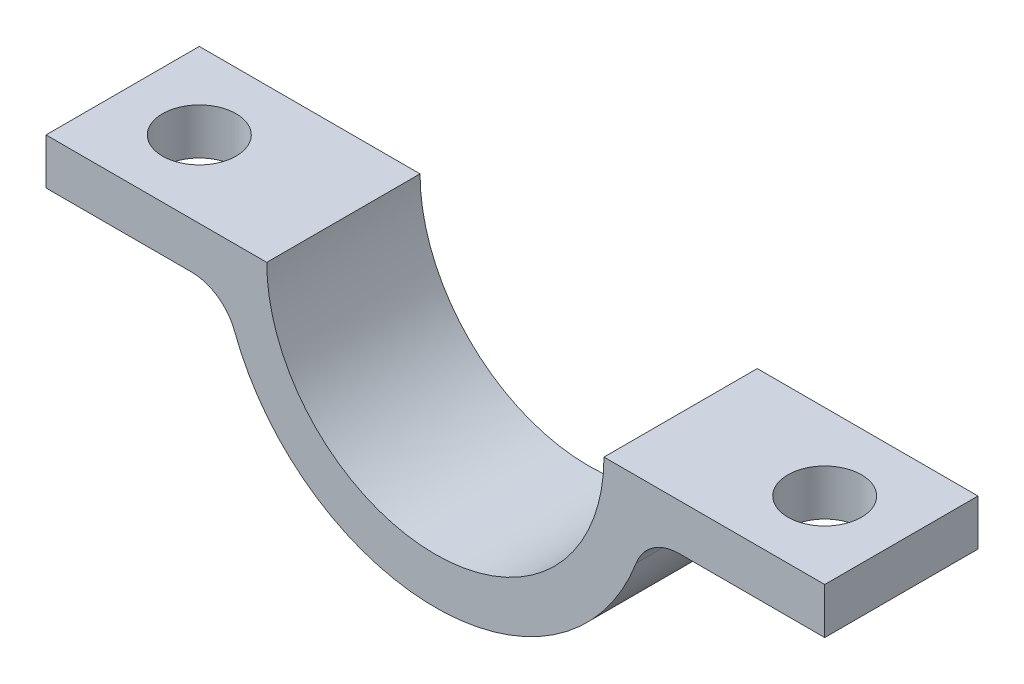
ISO-10303-21;
HEADER;
FILE_DESCRIPTION(('STEP AP214'),'2;1');
FILE_NAME('part.step','',(''),(''),'','','');
FILE_SCHEMA(('AUTOMOTIVE_DESIGN { 1 0 10303 214 1 1 1 1 }'));
ENDSEC;
DATA;
#1=APPLICATION_CONTEXT('core data for automotive mechanical design processes');
#2=APPLICATION_PROTOCOL_DEFINITION('international standard','automotive_design',2000,#1);
#3=PRODUCT_CONTEXT('',#1,'mechanical');
#4=PRODUCT('Part','Part','',(#3));
#5=PRODUCT_RELATED_PRODUCT_CATEGORY('part','',(#4));
#6=PRODUCT_DEFINITION_FORMATION('','',#4);
#7=PRODUCT_DEFINITION_CONTEXT('part definition',#1,'design');
#8=PRODUCT_DEFINITION('design','',#6,#7);
#9=PRODUCT_DEFINITION_SHAPE('','',#8);
#10=(LENGTH_UNIT() NAMED_UNIT(*) SI_UNIT(.MILLI.,.METRE.));
#11=(NAMED_UNIT(*) PLANE_ANGLE_UNIT() SI_UNIT($,.RADIAN.));
#12=(NAMED_UNIT(*) SI_UNIT($,.STERADIAN.) SOLID_ANGLE_UNIT());
#13=UNCERTAINTY_MEASURE_WITH_UNIT(LENGTH_MEASURE(1.E-05),#10,'distance_accuracy_value','');
#14=(GEOMETRIC_REPRESENTATION_CONTEXT(3) GLOBAL_UNCERTAINTY_ASSIGNED_CONTEXT((#13)) GLOBAL_UNIT_ASSIGNED_CONTEXT((#10,
#11,#12)) REPRESENTATION_CONTEXT('',''));
#15=CARTESIAN_POINT('',(0.,0.,0.));
#16=DIRECTION('',(0.,0.,1.));
#17=DIRECTION('',(1.,0.,0.));
#18=AXIS2_PLACEMENT_3D('',#15,#16,#17);
#19=CARTESIAN_POINT('',(12.7,0.,2.5));
#20=DIRECTION('',(-1.,0.,0.));
#21=DIRECTION('',(0.,0.,1.));
#22=AXIS2_PLACEMENT_3D('',#19,#20,#21);
#23=PLANE('',#22);
#24=DIRECTION('',(0.,1.,0.));
#25=VECTOR('',#24,1.);
#26=CARTESIAN_POINT('',(12.7,0.,-2.5));
#27=LINE('',#26,#25);
#28=CARTESIAN_POINT('',(12.7,-1.5,-2.5));
#29=VERTEX_POINT('',#28);
#30=CARTESIAN_POINT('',(12.7,0.,-2.5));
#31=VERTEX_POINT('',#30);
#32=EDGE_CURVE('E132',#29,#31,#27,.T.);
#33=ORIENTED_EDGE('',*,*,#32,.T.);
#34=DIRECTION('',(0.,0.,-1.));
#35=VECTOR('',#34,1.);
#36=CARTESIAN_POINT('',(12.7,0.,2.5));
#37=LINE('',#36,#35);
#38=CARTESIAN_POINT('',(12.7,0.,2.5));
#39=VERTEX_POINT('',#38);
#40=EDGE_CURVE('E113',#39,#31,#37,.T.);
#41=ORIENTED_EDGE('',*,*,#40,.F.);
#42=DIRECTION('',(0.,1.,0.));
#43=VECTOR('',#42,1.);
#44=CARTESIAN_POINT('',(12.7,0.,2.5));
#45=LINE('',#44,#43);
#46=CARTESIAN_POINT('',(12.7,-1.5,2.5));
#47=VERTEX_POINT('',#46);
#48=EDGE_CURVE('E120',#47,#39,#45,.T.);
#49=ORIENTED_EDGE('',*,*,#48,.F.);
#50=DIRECTION('',(0.,0.,-1.));
#51=VECTOR('',#50,1.);
#52=CARTESIAN_POINT('',(12.7,-1.5,2.5));
#53=LINE('',#52,#51);
#54=EDGE_CURVE('E167',#47,#29,#53,.T.);
#55=ORIENTED_EDGE('',*,*,#54,.T.);
#56=EDGE_LOOP('',(#33,#41,#49,#55));
#57=FACE_BOUND('',#56,.T.);
#58=ADVANCED_FACE('F32',(#57),#23,.F.);
#59=CARTESIAN_POINT('',(5.5,0.,2.5));
#60=DIRECTION('',(0.,-1.,0.));
#61=DIRECTION('',(1.,0.,0.));
#62=AXIS2_PLACEMENT_3D('',#59,#60,#61);
#63=PLANE('',#62);
#64=CARTESIAN_POINT('',(10.2,0.,0.));
#65=DIRECTION('',(0.,1.,0.));
#66=DIRECTION('',(0.,0.,-1.));
#67=AXIS2_PLACEMENT_3D('',#64,#65,#66);
#68=CIRCLE('',#67,1.2);
#69=CARTESIAN_POINT('',(10.2,0.,-1.2));
#70=VERTEX_POINT('',#69);
#71=EDGE_CURVE('E215',#70,#70,#68,.T.);
#72=ORIENTED_EDGE('',*,*,#71,.F.);
#73=EDGE_LOOP('',(#72));
#74=FACE_BOUND('',#73,.T.);
#75=DIRECTION('',(-1.,0.,0.));
#76=VECTOR('',#75,1.);
#77=CARTESIAN_POINT('',(5.5,0.,-2.5));
#78=LINE('',#77,#76);
#79=CARTESIAN_POINT('',(5.5,0.,-2.5));
#80=VERTEX_POINT('',#79);
#81=EDGE_CURVE('E203',#31,#80,#78,.T.);
#82=ORIENTED_EDGE('',*,*,#81,.T.);
#83=DIRECTION('',(0.,0.,-1.));
#84=VECTOR('',#83,1.);
#85=CARTESIAN_POINT('',(5.5,0.,2.5));
#86=LINE('',#85,#84);
#87=CARTESIAN_POINT('',(5.5,0.,2.5));
#88=VERTEX_POINT('',#87);
#89=EDGE_CURVE('E116',#88,#80,#86,.T.);
#90=ORIENTED_EDGE('',*,*,#89,.F.);
#91=DIRECTION('',(-1.,0.,0.));
#92=VECTOR('',#91,1.);
#93=CARTESIAN_POINT('',(5.5,0.,2.5));
#94=LINE('',#93,#92);
#95=EDGE_CURVE('E109',#39,#88,#94,.T.);
#96=ORIENTED_EDGE('',*,*,#95,.F.);
#97=ORIENTED_EDGE('',*,*,#40,.T.);
#98=EDGE_LOOP('',(#82,#90,#96,#97));
#99=FACE_BOUND('',#98,.T.);
#100=ADVANCED_FACE('F111',(#74,#99),#63,.F.);
#101=CARTESIAN_POINT('',(0.,0.,2.5));
#102=DIRECTION('',(0.,0.,-1.));
#103=DIRECTION('',(-1.,0.,0.));
#104=AXIS2_PLACEMENT_3D('',#101,#102,#103);
#105=CYLINDRICAL_SURFACE('',#104,5.5);
#106=CARTESIAN_POINT('',(0.,0.,-2.5));
#107=DIRECTION('',(0.,0.,-1.));
#108=DIRECTION('',(1.,0.,0.));
#109=AXIS2_PLACEMENT_3D('',#106,#107,#108);
#110=CIRCLE('',#109,5.5);
#111=CARTESIAN_POINT('',(-5.5,0.,-2.5));
#112=VERTEX_POINT('',#111);
#113=EDGE_CURVE('E201',#80,#112,#110,.T.);
#114=ORIENTED_EDGE('',*,*,#113,.T.);
#115=DIRECTION('',(0.,0.,-1.));
#116=VECTOR('',#115,1.);
#117=CARTESIAN_POINT('',(-5.5,0.,2.5));
#118=LINE('',#117,#116);
#119=CARTESIAN_POINT('',(-5.5,0.,2.5));
#120=VERTEX_POINT('',#119);
#121=EDGE_CURVE('E138',#120,#112,#118,.T.);
#122=ORIENTED_EDGE('',*,*,#121,.F.);
#123=CARTESIAN_POINT('',(0.,0.,2.5));
#124=DIRECTION('',(0.,0.,-1.));
#125=DIRECTION('',(1.,0.,0.));
#126=AXIS2_PLACEMENT_3D('',#123,#124,#125);
#127=CIRCLE('',#126,5.5);
#128=EDGE_CURVE('E119',#88,#120,#127,.T.);
#129=ORIENTED_EDGE('',*,*,#128,.F.);
#130=ORIENTED_EDGE('',*,*,#89,.T.);
#131=EDGE_LOOP('',(#114,#122,#129,#130));
#132=FACE_BOUND('',#131,.T.);
#133=ADVANCED_FACE('F226',(#132),#105,.F.);
#134=CARTESIAN_POINT('',(-5.5,0.,2.5));
#135=DIRECTION('',(0.,-1.,0.));
#136=DIRECTION('',(1.,0.,0.));
#137=AXIS2_PLACEMENT_3D('',#134,#135,#136);
#138=PLANE('',#137);
#139=CARTESIAN_POINT('',(-10.2,0.,0.));
#140=DIRECTION('',(0.,1.,0.));
#141=DIRECTION('',(0.,0.,1.));
#142=AXIS2_PLACEMENT_3D('',#139,#140,#141);
#143=CIRCLE('',#142,1.2);
#144=CARTESIAN_POINT('',(-10.2,0.,1.2));
#145=VERTEX_POINT('',#144);
#146=EDGE_CURVE('E146',#145,#145,#143,.T.);
#147=ORIENTED_EDGE('',*,*,#146,.F.);
#148=EDGE_LOOP('',(#147));
#149=FACE_BOUND('',#148,.T.);
#150=DIRECTION('',(-1.,0.,0.));
#151=VECTOR('',#150,1.);
#152=CARTESIAN_POINT('',(-5.5,0.,-2.5));
#153=LINE('',#152,#151);
#154=CARTESIAN_POINT('',(-12.7,0.,-2.5));
#155=VERTEX_POINT('',#154);
#156=EDGE_CURVE('E196',#112,#155,#153,.T.);
#157=ORIENTED_EDGE('',*,*,#156,.T.);
#158=DIRECTION('',(0.,0.,-1.));
#159=VECTOR('',#158,1.);
#160=CARTESIAN_POINT('',(-12.7,0.,2.5));
#161=LINE('',#160,#159);
#162=CARTESIAN_POINT('',(-12.7,0.,2.5));
#163=VERTEX_POINT('',#162);
#164=EDGE_CURVE('E187',#163,#155,#161,.T.);
#165=ORIENTED_EDGE('',*,*,#164,.F.);
#166=DIRECTION('',(-1.,0.,0.));
#167=VECTOR('',#166,1.);
#168=CARTESIAN_POINT('',(-5.5,0.,2.5));
#169=LINE('',#168,#167);
#170=EDGE_CURVE('E197',#120,#163,#169,.T.);
#171=ORIENTED_EDGE('',*,*,#170,.F.);
#172=ORIENTED_EDGE('',*,*,#121,.T.);
#173=EDGE_LOOP('',(#157,#165,#171,#172));
#174=FACE_BOUND('',#173,.T.);
#175=ADVANCED_FACE('F194',(#149,#174),#138,.F.);
#176=CARTESIAN_POINT('',(-12.7,0.,2.5));
#177=DIRECTION('',(1.,0.,0.));
#178=DIRECTION('',(0.,0.,-1.));
#179=AXIS2_PLACEMENT_3D('',#176,#177,#178);
#180=PLANE('',#179);
#181=DIRECTION('',(0.,-1.,0.));
#182=VECTOR('',#181,1.);
#183=CARTESIAN_POINT('',(-12.7,0.,-2.5));
#184=LINE('',#183,#182);
#185=CARTESIAN_POINT('',(-12.7,-1.5,-2.5));
#186=VERTEX_POINT('',#185);
#187=EDGE_CURVE('E179',#155,#186,#184,.T.);
#188=ORIENTED_EDGE('',*,*,#187,.T.);
#189=DIRECTION('',(0.,0.,-1.));
#190=VECTOR('',#189,1.);
#191=CARTESIAN_POINT('',(-12.7,-1.5,2.5));
#192=LINE('',#191,#190);
#193=CARTESIAN_POINT('',(-12.7,-1.5,2.5));
#194=VERTEX_POINT('',#193);
#195=EDGE_CURVE('E184',#194,#186,#192,.T.);
#196=ORIENTED_EDGE('',*,*,#195,.F.);
#197=DIRECTION('',(0.,-1.,0.));
#198=VECTOR('',#197,1.);
#199=CARTESIAN_POINT('',(-12.7,0.,2.5));
#200=LINE('',#199,#198);
#201=EDGE_CURVE('E211',#163,#194,#200,.T.);
#202=ORIENTED_EDGE('',*,*,#201,.F.);
#203=ORIENTED_EDGE('',*,*,#164,.T.);
#204=EDGE_LOOP('',(#188,#196,#202,#203));
#205=FACE_BOUND('',#204,.T.);
#206=ADVANCED_FACE('F225',(#205),#180,.F.);
#207=CARTESIAN_POINT('',(-12.7,-1.5,2.5));
#208=DIRECTION('',(0.,1.,0.));
#209=DIRECTION('',(-1.,0.,0.));
#210=AXIS2_PLACEMENT_3D('',#207,#208,#209);
#211=PLANE('',#210);
#212=CARTESIAN_POINT('',(-10.2,-1.5,0.));
#213=DIRECTION('',(0.,1.,0.));
#214=DIRECTION('',(-1.,0.,0.));
#215=AXIS2_PLACEMENT_3D('',#212,#213,#214);
#216=CIRCLE('',#215,1.2);
#217=CARTESIAN_POINT('',(-11.4,-1.5,0.));
#218=VERTEX_POINT('',#217);
#219=EDGE_CURVE('E145',#218,#218,#216,.T.);
#220=ORIENTED_EDGE('',*,*,#219,.T.);
#221=EDGE_LOOP('',(#220));
#222=FACE_BOUND('',#221,.T.);
#223=DIRECTION('',(1.,0.,0.));
#224=VECTOR('',#223,1.);
#225=CARTESIAN_POINT('',(-12.7,-1.5,-2.5));
#226=LINE('',#225,#224);
#227=CARTESIAN_POINT('',(-7.95298686029343,-1.5,-2.5));
#228=VERTEX_POINT('',#227);
#229=EDGE_CURVE('E176',#186,#228,#226,.T.);
#230=ORIENTED_EDGE('',*,*,#229,.T.);
#231=DIRECTION('',(0.,0.,1.));
#232=VECTOR('',#231,1.);
#233=CARTESIAN_POINT('',(-7.95298686029343,-1.5,2.5));
#234=LINE('',#233,#232);
#235=CARTESIAN_POINT('',(-7.95298686029343,-1.5,2.5));
#236=VERTEX_POINT('',#235);
#237=EDGE_CURVE('E47',#228,#236,#234,.T.);
#238=ORIENTED_EDGE('',*,*,#237,.T.);
#239=DIRECTION('',(1.,0.,0.));
#240=VECTOR('',#239,1.);
#241=CARTESIAN_POINT('',(-12.7,-1.5,2.5));
#242=LINE('',#241,#240);
#243=EDGE_CURVE('E209',#194,#236,#242,.T.);
#244=ORIENTED_EDGE('',*,*,#243,.F.);
#245=ORIENTED_EDGE('',*,*,#195,.T.);
#246=EDGE_LOOP('',(#230,#238,#244,#245));
#247=FACE_BOUND('',#246,.T.);
#248=ADVANCED_FACE('F232',(#222,#247),#211,.F.);
#249=CARTESIAN_POINT('',(0.,0.,2.5));
#250=DIRECTION('',(0.,0.,-1.));
#251=DIRECTION('',(-1.,0.,0.));
#252=AXIS2_PLACEMENT_3D('',#249,#250,#251);
#253=CYLINDRICAL_SURFACE('',#252,7.);
#254=CARTESIAN_POINT('',(0.,0.,-2.5));
#255=DIRECTION('',(0.,0.,1.));
#256=DIRECTION('',(1.,0.,0.));
#257=AXIS2_PLACEMENT_3D('',#254,#255,#256);
#258=CIRCLE('',#257,7.);
#259=CARTESIAN_POINT('',(-6.54951859082989,-2.47058823529412,-2.5));
#260=VERTEX_POINT('',#259);
#261=CARTESIAN_POINT('',(6.54951859082989,-2.47058823529412,-2.5));
#262=VERTEX_POINT('',#261);
#263=EDGE_CURVE('E172',#260,#262,#258,.T.);
#264=ORIENTED_EDGE('',*,*,#263,.T.);
#265=DIRECTION('',(0.,0.,-1.));
#266=VECTOR('',#265,1.);
#267=CARTESIAN_POINT('',(6.54951859082989,-2.47058823529412,2.5));
#268=LINE('',#267,#266);
#269=CARTESIAN_POINT('',(6.54951859082989,-2.47058823529412,2.5));
#270=VERTEX_POINT('',#269);
#271=EDGE_CURVE('E151',#262,#270,#268,.F.);
#272=ORIENTED_EDGE('',*,*,#271,.T.);
#273=CARTESIAN_POINT('',(0.,0.,2.5));
#274=DIRECTION('',(0.,0.,1.));
#275=DIRECTION('',(1.,0.,0.));
#276=AXIS2_PLACEMENT_3D('',#273,#274,#275);
#277=CIRCLE('',#276,7.);
#278=CARTESIAN_POINT('',(-6.54951859082989,-2.47058823529412,2.5));
#279=VERTEX_POINT('',#278);
#280=EDGE_CURVE('E160',#279,#270,#277,.T.);
#281=ORIENTED_EDGE('',*,*,#280,.F.);
#282=DIRECTION('',(0.,0.,-1.));
#283=VECTOR('',#282,1.);
#284=CARTESIAN_POINT('',(-6.54951859082988,-2.47058823529412,2.5));
#285=LINE('',#284,#283);
#286=EDGE_CURVE('E136',#279,#260,#285,.T.);
#287=ORIENTED_EDGE('',*,*,#286,.T.);
#288=EDGE_LOOP('',(#264,#272,#281,#287));
#289=FACE_BOUND('',#288,.T.);
#290=ADVANCED_FACE('F174',(#289),#253,.T.);
#291=CARTESIAN_POINT('',(12.7,-1.5,2.5));
#292=DIRECTION('',(0.,1.,0.));
#293=DIRECTION('',(-1.,0.,0.));
#294=AXIS2_PLACEMENT_3D('',#291,#292,#293);
#295=PLANE('',#294);
#296=CARTESIAN_POINT('',(10.2,-1.5,0.));
#297=DIRECTION('',(0.,1.,0.));
#298=DIRECTION('',(-1.,0.,0.));
#299=AXIS2_PLACEMENT_3D('',#296,#297,#298);
#300=CIRCLE('',#299,1.2);
#301=CARTESIAN_POINT('',(9.,-1.5,0.));
#302=VERTEX_POINT('',#301);
#303=EDGE_CURVE('E142',#302,#302,#300,.T.);
#304=ORIENTED_EDGE('',*,*,#303,.T.);
#305=EDGE_LOOP('',(#304));
#306=FACE_BOUND('',#305,.T.);
#307=DIRECTION('',(1.,0.,0.));
#308=VECTOR('',#307,1.);
#309=CARTESIAN_POINT('',(12.7,-1.5,2.5));
#310=LINE('',#309,#308);
#311=CARTESIAN_POINT('',(7.95298686029343,-1.5,2.5));
#312=VERTEX_POINT('',#311);
#313=EDGE_CURVE('E125',#312,#47,#310,.T.);
#314=ORIENTED_EDGE('',*,*,#313,.F.);
#315=DIRECTION('',(0.,0.,1.));
#316=VECTOR('',#315,1.);
#317=CARTESIAN_POINT('',(7.95298686029343,-1.5,-2.5));
#318=LINE('',#317,#316);
#319=CARTESIAN_POINT('',(7.95298686029343,-1.5,-2.5));
#320=VERTEX_POINT('',#319);
#321=EDGE_CURVE('E133',#312,#320,#318,.F.);
#322=ORIENTED_EDGE('',*,*,#321,.T.);
#323=DIRECTION('',(1.,0.,0.));
#324=VECTOR('',#323,1.);
#325=CARTESIAN_POINT('',(12.7,-1.5,-2.5));
#326=LINE('',#325,#324);
#327=EDGE_CURVE('E129',#320,#29,#326,.T.);
#328=ORIENTED_EDGE('',*,*,#327,.T.);
#329=ORIENTED_EDGE('',*,*,#54,.F.);
#330=EDGE_LOOP('',(#314,#322,#328,#329));
#331=FACE_BOUND('',#330,.T.);
#332=ADVANCED_FACE('F165',(#306,#331),#295,.F.);
#333=CARTESIAN_POINT('',(0.,0.,2.5));
#334=DIRECTION('',(0.,0.,1.));
#335=DIRECTION('',(1.,0.,0.));
#336=AXIS2_PLACEMENT_3D('',#333,#334,#335);
#337=PLANE('',#336);
#338=ORIENTED_EDGE('',*,*,#48,.T.);
#339=ORIENTED_EDGE('',*,*,#95,.T.);
#340=ORIENTED_EDGE('',*,*,#128,.T.);
#341=ORIENTED_EDGE('',*,*,#170,.T.);
#342=ORIENTED_EDGE('',*,*,#201,.T.);
#343=ORIENTED_EDGE('',*,*,#243,.T.);
#344=CARTESIAN_POINT('',(-7.95298686029343,-3.,2.5));
#345=DIRECTION('',(0.,0.,1.));
#346=DIRECTION('',(1.,0.,0.));
#347=AXIS2_PLACEMENT_3D('',#344,#345,#346);
#348=CIRCLE('',#347,1.5);
#349=EDGE_CURVE('E11',#236,#279,#348,.F.);
#350=ORIENTED_EDGE('',*,*,#349,.T.);
#351=ORIENTED_EDGE('',*,*,#280,.T.);
#352=CARTESIAN_POINT('',(7.95298686029343,-3.,2.5));
#353=DIRECTION('',(0.,0.,1.));
#354=DIRECTION('',(1.,0.,0.));
#355=AXIS2_PLACEMENT_3D('',#352,#353,#354);
#356=CIRCLE('',#355,1.5);
#357=EDGE_CURVE('E156',#270,#312,#356,.F.);
#358=ORIENTED_EDGE('',*,*,#357,.T.);
#359=ORIENTED_EDGE('',*,*,#313,.T.);
#360=EDGE_LOOP('',(#338,#339,#340,#341,#342,#343,#350,#351,#358,#359));
#361=FACE_BOUND('',#360,.T.);
#362=ADVANCED_FACE('F123',(#361),#337,.T.);
#363=CARTESIAN_POINT('',(0.,0.,-2.5));
#364=DIRECTION('',(0.,0.,1.));
#365=DIRECTION('',(1.,0.,0.));
#366=AXIS2_PLACEMENT_3D('',#363,#364,#365);
#367=PLANE('',#366);
#368=ORIENTED_EDGE('',*,*,#32,.F.);
#369=ORIENTED_EDGE('',*,*,#327,.F.);
#370=CARTESIAN_POINT('',(7.95298686029343,-3.,-2.5));
#371=DIRECTION('',(0.,0.,1.));
#372=DIRECTION('',(1.,0.,0.));
#373=AXIS2_PLACEMENT_3D('',#370,#371,#372);
#374=CIRCLE('',#373,1.5);
#375=EDGE_CURVE('E154',#320,#262,#374,.T.);
#376=ORIENTED_EDGE('',*,*,#375,.T.);
#377=ORIENTED_EDGE('',*,*,#263,.F.);
#378=CARTESIAN_POINT('',(-7.95298686029343,-3.,-2.5));
#379=DIRECTION('',(0.,0.,1.));
#380=DIRECTION('',(1.,0.,0.));
#381=AXIS2_PLACEMENT_3D('',#378,#379,#380);
#382=CIRCLE('',#381,1.5);
#383=EDGE_CURVE('E40',#260,#228,#382,.T.);
#384=ORIENTED_EDGE('',*,*,#383,.T.);
#385=ORIENTED_EDGE('',*,*,#229,.F.);
#386=ORIENTED_EDGE('',*,*,#187,.F.);
#387=ORIENTED_EDGE('',*,*,#156,.F.);
#388=ORIENTED_EDGE('',*,*,#113,.F.);
#389=ORIENTED_EDGE('',*,*,#81,.F.);
#390=EDGE_LOOP('',(#368,#369,#376,#377,#384,#385,#386,#387,#388,#389));
#391=FACE_BOUND('',#390,.T.);
#392=ADVANCED_FACE('F171',(#391),#367,.F.);
#393=CARTESIAN_POINT('',(10.2,-7.,0.));
#394=DIRECTION('',(0.,1.,0.));
#395=DIRECTION('',(0.,0.,1.));
#396=AXIS2_PLACEMENT_3D('',#393,#394,#395);
#397=CYLINDRICAL_SURFACE('',#396,1.2);
#398=ORIENTED_EDGE('',*,*,#71,.T.);
#399=EDGE_LOOP('',(#398));
#400=FACE_BOUND('',#399,.T.);
#401=ORIENTED_EDGE('',*,*,#303,.F.);
#402=EDGE_LOOP('',(#401));
#403=FACE_BOUND('',#402,.T.);
#404=ADVANCED_FACE('F249',(#400,#403),#397,.F.);
#405=CARTESIAN_POINT('',(-10.2,-7.,0.));
#406=DIRECTION('',(0.,1.,0.));
#407=DIRECTION('',(0.,0.,1.));
#408=AXIS2_PLACEMENT_3D('',#405,#406,#407);
#409=CYLINDRICAL_SURFACE('',#408,1.2);
#410=ORIENTED_EDGE('',*,*,#146,.T.);
#411=EDGE_LOOP('',(#410));
#412=FACE_BOUND('',#411,.T.);
#413=ORIENTED_EDGE('',*,*,#219,.F.);
#414=EDGE_LOOP('',(#413));
#415=FACE_BOUND('',#414,.T.);
#416=ADVANCED_FACE('F221',(#412,#415),#409,.F.);
#417=CARTESIAN_POINT('',(7.95298686029343,-3.,2.5));
#418=DIRECTION('',(0.,0.,-1.));
#419=DIRECTION('',(-1.,0.,0.));
#420=AXIS2_PLACEMENT_3D('',#417,#418,#419);
#421=CYLINDRICAL_SURFACE('',#420,1.5);
#422=ORIENTED_EDGE('',*,*,#357,.F.);
#423=ORIENTED_EDGE('',*,*,#271,.F.);
#424=ORIENTED_EDGE('',*,*,#375,.F.);
#425=ORIENTED_EDGE('',*,*,#321,.F.);
#426=EDGE_LOOP('',(#422,#423,#424,#425));
#427=FACE_BOUND('',#426,.T.);
#428=ADVANCED_FACE('F169',(#427),#421,.F.);
#429=CARTESIAN_POINT('',(-7.95298686029343,-3.,2.5));
#430=DIRECTION('',(0.,0.,-1.));
#431=DIRECTION('',(-1.,0.,0.));
#432=AXIS2_PLACEMENT_3D('',#429,#430,#431);
#433=CYLINDRICAL_SURFACE('',#432,1.5);
#434=ORIENTED_EDGE('',*,*,#349,.F.);
#435=ORIENTED_EDGE('',*,*,#237,.F.);
#436=ORIENTED_EDGE('',*,*,#383,.F.);
#437=ORIENTED_EDGE('',*,*,#286,.F.);
#438=EDGE_LOOP('',(#434,#435,#436,#437));
#439=FACE_BOUND('',#438,.T.);
#440=ADVANCED_FACE('F34',(#439),#433,.F.);
#441=CLOSED_SHELL('',(#58,#100,#133,#175,#206,#248,#290,#332,#362,#392,#404,#416,#428,#440));
#442=MANIFOLD_SOLID_BREP('B2',#441);
#443=ADVANCED_BREP_SHAPE_REPRESENTATION('',(#18,#442),#14);
#444=SHAPE_DEFINITION_REPRESENTATION(#9,#443);
ENDSEC;
END-ISO-10303-21;
